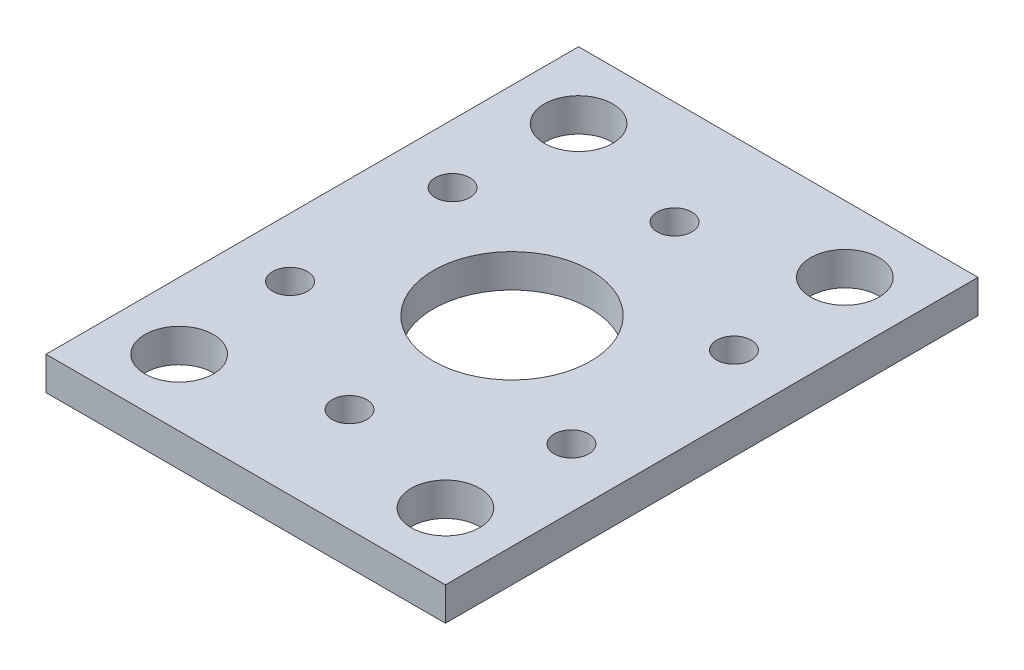
ISO-10303-21;
HEADER;
FILE_DESCRIPTION(('STEP AP214'),'2;1');
FILE_NAME('part.step','',(''),(''),'','','');
FILE_SCHEMA(('AUTOMOTIVE_DESIGN { 1 0 10303 214 1 1 1 1 }'));
ENDSEC;
DATA;
#1=APPLICATION_CONTEXT('core data for automotive mechanical design processes');
#2=APPLICATION_PROTOCOL_DEFINITION('international standard','automotive_design',2000,#1);
#3=PRODUCT_CONTEXT('',#1,'mechanical');
#4=PRODUCT('Part','Part','',(#3));
#5=PRODUCT_RELATED_PRODUCT_CATEGORY('part','',(#4));
#6=PRODUCT_DEFINITION_FORMATION('','',#4);
#7=PRODUCT_DEFINITION_CONTEXT('part definition',#1,'design');
#8=PRODUCT_DEFINITION('design','',#6,#7);
#9=PRODUCT_DEFINITION_SHAPE('','',#8);
#10=(LENGTH_UNIT() NAMED_UNIT(*) SI_UNIT(.MILLI.,.METRE.));
#11=(NAMED_UNIT(*) PLANE_ANGLE_UNIT() SI_UNIT($,.RADIAN.));
#12=(NAMED_UNIT(*) SI_UNIT($,.STERADIAN.) SOLID_ANGLE_UNIT());
#13=UNCERTAINTY_MEASURE_WITH_UNIT(LENGTH_MEASURE(1.E-05),#10,'distance_accuracy_value','');
#14=(GEOMETRIC_REPRESENTATION_CONTEXT(3) GLOBAL_UNCERTAINTY_ASSIGNED_CONTEXT((#13)) GLOBAL_UNIT_ASSIGNED_CONTEXT((#10,
#11,#12)) REPRESENTATION_CONTEXT('',''));
#15=CARTESIAN_POINT('',(0.,0.,0.));
#16=DIRECTION('',(0.,0.,1.));
#17=DIRECTION('',(1.,0.,0.));
#18=AXIS2_PLACEMENT_3D('',#15,#16,#17);
#19=CARTESIAN_POINT('',(0.,3.175,0.));
#20=DIRECTION('',(0.,-1.,0.));
#21=DIRECTION('',(0.,0.,-1.));
#22=AXIS2_PLACEMENT_3D('',#19,#20,#21);
#23=PLANE('',#22);
#24=DIRECTION('',(1.,0.,0.));
#25=VECTOR('',#24,1.);
#26=CARTESIAN_POINT('',(0.,3.175,50.8));
#27=LINE('',#26,#25);
#28=CARTESIAN_POINT('',(0.,3.175,50.8));
#29=VERTEX_POINT('',#28);
#30=CARTESIAN_POINT('',(38.1,3.175,50.8));
#31=VERTEX_POINT('',#30);
#32=EDGE_CURVE('E89',#29,#31,#27,.T.);
#33=ORIENTED_EDGE('',*,*,#32,.T.);
#34=DIRECTION('',(0.,0.,-1.));
#35=VECTOR('',#34,1.);
#36=CARTESIAN_POINT('',(38.1,3.175,0.));
#37=LINE('',#36,#35);
#38=CARTESIAN_POINT('',(38.1,3.175,0.));
#39=VERTEX_POINT('',#38);
#40=EDGE_CURVE('E84',#31,#39,#37,.T.);
#41=ORIENTED_EDGE('',*,*,#40,.T.);
#42=DIRECTION('',(-1.,0.,0.));
#43=VECTOR('',#42,1.);
#44=CARTESIAN_POINT('',(0.,3.175,0.));
#45=LINE('',#44,#43);
#46=CARTESIAN_POINT('',(0.,3.175,0.));
#47=VERTEX_POINT('',#46);
#48=EDGE_CURVE('E87',#39,#47,#45,.T.);
#49=ORIENTED_EDGE('',*,*,#48,.T.);
#50=DIRECTION('',(0.,0.,1.));
#51=VECTOR('',#50,1.);
#52=CARTESIAN_POINT('',(0.,3.175,50.8));
#53=LINE('',#52,#51);
#54=EDGE_CURVE('E54',#47,#29,#53,.T.);
#55=ORIENTED_EDGE('',*,*,#54,.T.);
#56=EDGE_LOOP('',(#33,#41,#49,#55));
#57=FACE_BOUND('',#56,.T.);
#58=CARTESIAN_POINT('',(19.05,3.175,40.9));
#59=DIRECTION('',(0.,1.,0.));
#60=DIRECTION('',(0.,0.,1.));
#61=AXIS2_PLACEMENT_3D('',#58,#59,#60);
#62=CIRCLE('',#61,1.65);
#63=CARTESIAN_POINT('',(19.05,3.175,42.55));
#64=VERTEX_POINT('',#63);
#65=EDGE_CURVE('E104',#64,#64,#62,.T.);
#66=ORIENTED_EDGE('',*,*,#65,.F.);
#67=EDGE_LOOP('',(#66));
#68=FACE_BOUND('',#67,.T.);
#69=CARTESIAN_POINT('',(6.35,3.175,6.35));
#70=DIRECTION('',(0.,1.,0.));
#71=DIRECTION('',(0.,0.,1.));
#72=AXIS2_PLACEMENT_3D('',#69,#70,#71);
#73=CIRCLE('',#72,3.2639);
#74=CARTESIAN_POINT('',(6.35,3.175,9.6139));
#75=VERTEX_POINT('',#74);
#76=EDGE_CURVE('E119',#75,#75,#73,.T.);
#77=ORIENTED_EDGE('',*,*,#76,.F.);
#78=EDGE_LOOP('',(#77));
#79=FACE_BOUND('',#78,.T.);
#80=CARTESIAN_POINT('',(5.6266062413412,3.175,33.15));
#81=DIRECTION('',(0.,1.,0.));
#82=DIRECTION('',(0.,0.,1.));
#83=AXIS2_PLACEMENT_3D('',#80,#81,#82);
#84=CIRCLE('',#83,1.65);
#85=CARTESIAN_POINT('',(5.6266062413412,3.175,34.8));
#86=VERTEX_POINT('',#85);
#87=EDGE_CURVE('E125',#86,#86,#84,.T.);
#88=ORIENTED_EDGE('',*,*,#87,.F.);
#89=EDGE_LOOP('',(#88));
#90=FACE_BOUND('',#89,.T.);
#91=CARTESIAN_POINT('',(5.6266062413412,3.175,17.65));
#92=DIRECTION('',(0.,1.,0.));
#93=DIRECTION('',(0.,0.,1.));
#94=AXIS2_PLACEMENT_3D('',#91,#92,#93);
#95=CIRCLE('',#94,1.65);
#96=CARTESIAN_POINT('',(5.6266062413412,3.175,19.3));
#97=VERTEX_POINT('',#96);
#98=EDGE_CURVE('E131',#97,#97,#95,.T.);
#99=ORIENTED_EDGE('',*,*,#98,.F.);
#100=EDGE_LOOP('',(#99));
#101=FACE_BOUND('',#100,.T.);
#102=CARTESIAN_POINT('',(19.05,3.175,9.9));
#103=DIRECTION('',(0.,1.,0.));
#104=DIRECTION('',(0.,0.,1.));
#105=AXIS2_PLACEMENT_3D('',#102,#103,#104);
#106=CIRCLE('',#105,1.65);
#107=CARTESIAN_POINT('',(19.05,3.175,11.55));
#108=VERTEX_POINT('',#107);
#109=EDGE_CURVE('E137',#108,#108,#106,.T.);
#110=ORIENTED_EDGE('',*,*,#109,.F.);
#111=EDGE_LOOP('',(#110));
#112=FACE_BOUND('',#111,.T.);
#113=CARTESIAN_POINT('',(32.4733937586588,3.175,17.65));
#114=DIRECTION('',(0.,1.,0.));
#115=DIRECTION('',(0.,0.,1.));
#116=AXIS2_PLACEMENT_3D('',#113,#114,#115);
#117=CIRCLE('',#116,1.65);
#118=CARTESIAN_POINT('',(32.4733937586588,3.175,19.3));
#119=VERTEX_POINT('',#118);
#120=EDGE_CURVE('E143',#119,#119,#117,.T.);
#121=ORIENTED_EDGE('',*,*,#120,.F.);
#122=EDGE_LOOP('',(#121));
#123=FACE_BOUND('',#122,.T.);
#124=CARTESIAN_POINT('',(32.4733937586588,3.175,33.15));
#125=DIRECTION('',(0.,1.,0.));
#126=DIRECTION('',(0.,0.,1.));
#127=AXIS2_PLACEMENT_3D('',#124,#125,#126);
#128=CIRCLE('',#127,1.65);
#129=CARTESIAN_POINT('',(32.4733937586588,3.175,34.8));
#130=VERTEX_POINT('',#129);
#131=EDGE_CURVE('E149',#130,#130,#128,.T.);
#132=ORIENTED_EDGE('',*,*,#131,.F.);
#133=EDGE_LOOP('',(#132));
#134=FACE_BOUND('',#133,.T.);
#135=CARTESIAN_POINT('',(31.75,3.175,6.35));
#136=DIRECTION('',(0.,1.,0.));
#137=DIRECTION('',(0.,0.,1.));
#138=AXIS2_PLACEMENT_3D('',#135,#136,#137);
#139=CIRCLE('',#138,3.2639);
#140=CARTESIAN_POINT('',(31.75,3.175,9.6139));
#141=VERTEX_POINT('',#140);
#142=EDGE_CURVE('E155',#141,#141,#139,.T.);
#143=ORIENTED_EDGE('',*,*,#142,.F.);
#144=EDGE_LOOP('',(#143));
#145=FACE_BOUND('',#144,.T.);
#146=CARTESIAN_POINT('',(6.35,3.175,44.45));
#147=DIRECTION('',(0.,1.,0.));
#148=DIRECTION('',(0.,0.,1.));
#149=AXIS2_PLACEMENT_3D('',#146,#147,#148);
#150=CIRCLE('',#149,3.2639);
#151=CARTESIAN_POINT('',(6.35,3.175,47.7139));
#152=VERTEX_POINT('',#151);
#153=EDGE_CURVE('E161',#152,#152,#150,.T.);
#154=ORIENTED_EDGE('',*,*,#153,.F.);
#155=EDGE_LOOP('',(#154));
#156=FACE_BOUND('',#155,.T.);
#157=CARTESIAN_POINT('',(19.05,3.175,25.4));
#158=DIRECTION('',(0.,1.,0.));
#159=DIRECTION('',(0.,0.,1.));
#160=AXIS2_PLACEMENT_3D('',#157,#158,#159);
#161=CIRCLE('',#160,7.50000000000001);
#162=CARTESIAN_POINT('',(19.05,3.175,32.9));
#163=VERTEX_POINT('',#162);
#164=EDGE_CURVE('E167',#163,#163,#161,.T.);
#165=ORIENTED_EDGE('',*,*,#164,.F.);
#166=EDGE_LOOP('',(#165));
#167=FACE_BOUND('',#166,.T.);
#168=CARTESIAN_POINT('',(31.75,3.175,44.45));
#169=DIRECTION('',(0.,1.,0.));
#170=DIRECTION('',(0.,0.,1.));
#171=AXIS2_PLACEMENT_3D('',#168,#169,#170);
#172=CIRCLE('',#171,3.2639);
#173=CARTESIAN_POINT('',(31.75,3.175,47.7139));
#174=VERTEX_POINT('',#173);
#175=EDGE_CURVE('E173',#174,#174,#172,.T.);
#176=ORIENTED_EDGE('',*,*,#175,.F.);
#177=EDGE_LOOP('',(#176));
#178=FACE_BOUND('',#177,.T.);
#179=ADVANCED_FACE('F37',(#57,#68,#79,#90,#101,#112,#123,#134,#145,#156,#167,#178),#23,.F.);
#180=CARTESIAN_POINT('',(0.,0.,0.));
#181=DIRECTION('',(0.,-1.,0.));
#182=DIRECTION('',(0.,0.,-1.));
#183=AXIS2_PLACEMENT_3D('',#180,#181,#182);
#184=PLANE('',#183);
#185=CARTESIAN_POINT('',(19.05,0.,25.4));
#186=DIRECTION('',(0.,1.,0.));
#187=DIRECTION('',(0.,0.,1.));
#188=AXIS2_PLACEMENT_3D('',#185,#186,#187);
#189=CIRCLE('',#188,7.50000000000001);
#190=CARTESIAN_POINT('',(19.05,0.,32.9));
#191=VERTEX_POINT('',#190);
#192=EDGE_CURVE('E170',#191,#191,#189,.T.);
#193=ORIENTED_EDGE('',*,*,#192,.T.);
#194=EDGE_LOOP('',(#193));
#195=FACE_BOUND('',#194,.T.);
#196=CARTESIAN_POINT('',(31.75,0.,6.35));
#197=DIRECTION('',(0.,1.,0.));
#198=DIRECTION('',(0.,0.,1.));
#199=AXIS2_PLACEMENT_3D('',#196,#197,#198);
#200=CIRCLE('',#199,3.2639);
#201=CARTESIAN_POINT('',(31.75,0.,9.6139));
#202=VERTEX_POINT('',#201);
#203=EDGE_CURVE('E158',#202,#202,#200,.T.);
#204=ORIENTED_EDGE('',*,*,#203,.T.);
#205=EDGE_LOOP('',(#204));
#206=FACE_BOUND('',#205,.T.);
#207=CARTESIAN_POINT('',(32.4733937586588,0.,17.65));
#208=DIRECTION('',(0.,1.,0.));
#209=DIRECTION('',(0.,0.,1.));
#210=AXIS2_PLACEMENT_3D('',#207,#208,#209);
#211=CIRCLE('',#210,1.65);
#212=CARTESIAN_POINT('',(32.4733937586588,0.,19.3));
#213=VERTEX_POINT('',#212);
#214=EDGE_CURVE('E146',#213,#213,#211,.T.);
#215=ORIENTED_EDGE('',*,*,#214,.T.);
#216=EDGE_LOOP('',(#215));
#217=FACE_BOUND('',#216,.T.);
#218=CARTESIAN_POINT('',(5.6266062413412,0.,17.65));
#219=DIRECTION('',(0.,1.,0.));
#220=DIRECTION('',(0.,0.,1.));
#221=AXIS2_PLACEMENT_3D('',#218,#219,#220);
#222=CIRCLE('',#221,1.65);
#223=CARTESIAN_POINT('',(5.6266062413412,0.,19.3));
#224=VERTEX_POINT('',#223);
#225=EDGE_CURVE('E134',#224,#224,#222,.T.);
#226=ORIENTED_EDGE('',*,*,#225,.T.);
#227=EDGE_LOOP('',(#226));
#228=FACE_BOUND('',#227,.T.);
#229=CARTESIAN_POINT('',(6.35,0.,6.35));
#230=DIRECTION('',(0.,1.,0.));
#231=DIRECTION('',(0.,0.,1.));
#232=AXIS2_PLACEMENT_3D('',#229,#230,#231);
#233=CIRCLE('',#232,3.2639);
#234=CARTESIAN_POINT('',(6.35,0.,9.6139));
#235=VERTEX_POINT('',#234);
#236=EDGE_CURVE('E122',#235,#235,#233,.T.);
#237=ORIENTED_EDGE('',*,*,#236,.T.);
#238=EDGE_LOOP('',(#237));
#239=FACE_BOUND('',#238,.T.);
#240=DIRECTION('',(1.,0.,0.));
#241=VECTOR('',#240,1.);
#242=CARTESIAN_POINT('',(0.,0.,50.8));
#243=LINE('',#242,#241);
#244=CARTESIAN_POINT('',(0.,0.,50.8));
#245=VERTEX_POINT('',#244);
#246=CARTESIAN_POINT('',(38.1,0.,50.8));
#247=VERTEX_POINT('',#246);
#248=EDGE_CURVE('E101',#245,#247,#243,.T.);
#249=ORIENTED_EDGE('',*,*,#248,.F.);
#250=DIRECTION('',(0.,0.,1.));
#251=VECTOR('',#250,1.);
#252=CARTESIAN_POINT('',(0.,0.,50.8));
#253=LINE('',#252,#251);
#254=CARTESIAN_POINT('',(0.,0.,0.));
#255=VERTEX_POINT('',#254);
#256=EDGE_CURVE('E77',#255,#245,#253,.T.);
#257=ORIENTED_EDGE('',*,*,#256,.F.);
#258=DIRECTION('',(-1.,0.,0.));
#259=VECTOR('',#258,1.);
#260=CARTESIAN_POINT('',(0.,0.,0.));
#261=LINE('',#260,#259);
#262=CARTESIAN_POINT('',(38.1,0.,0.));
#263=VERTEX_POINT('',#262);
#264=EDGE_CURVE('E71',#263,#255,#261,.T.);
#265=ORIENTED_EDGE('',*,*,#264,.F.);
#266=DIRECTION('',(0.,0.,-1.));
#267=VECTOR('',#266,1.);
#268=CARTESIAN_POINT('',(38.1,0.,0.));
#269=LINE('',#268,#267);
#270=EDGE_CURVE('E93',#247,#263,#269,.T.);
#271=ORIENTED_EDGE('',*,*,#270,.F.);
#272=EDGE_LOOP('',(#249,#257,#265,#271));
#273=FACE_BOUND('',#272,.T.);
#274=CARTESIAN_POINT('',(19.05,0.,40.9));
#275=DIRECTION('',(0.,1.,0.));
#276=DIRECTION('',(0.,0.,1.));
#277=AXIS2_PLACEMENT_3D('',#274,#275,#276);
#278=CIRCLE('',#277,1.65);
#279=CARTESIAN_POINT('',(19.05,0.,42.55));
#280=VERTEX_POINT('',#279);
#281=EDGE_CURVE('E116',#280,#280,#278,.T.);
#282=ORIENTED_EDGE('',*,*,#281,.T.);
#283=EDGE_LOOP('',(#282));
#284=FACE_BOUND('',#283,.T.);
#285=CARTESIAN_POINT('',(5.6266062413412,0.,33.15));
#286=DIRECTION('',(0.,1.,0.));
#287=DIRECTION('',(0.,0.,1.));
#288=AXIS2_PLACEMENT_3D('',#285,#286,#287);
#289=CIRCLE('',#288,1.65);
#290=CARTESIAN_POINT('',(5.6266062413412,0.,34.8));
#291=VERTEX_POINT('',#290);
#292=EDGE_CURVE('E128',#291,#291,#289,.T.);
#293=ORIENTED_EDGE('',*,*,#292,.T.);
#294=EDGE_LOOP('',(#293));
#295=FACE_BOUND('',#294,.T.);
#296=CARTESIAN_POINT('',(19.05,0.,9.9));
#297=DIRECTION('',(0.,1.,0.));
#298=DIRECTION('',(0.,0.,1.));
#299=AXIS2_PLACEMENT_3D('',#296,#297,#298);
#300=CIRCLE('',#299,1.65);
#301=CARTESIAN_POINT('',(19.05,0.,11.55));
#302=VERTEX_POINT('',#301);
#303=EDGE_CURVE('E140',#302,#302,#300,.T.);
#304=ORIENTED_EDGE('',*,*,#303,.T.);
#305=EDGE_LOOP('',(#304));
#306=FACE_BOUND('',#305,.T.);
#307=CARTESIAN_POINT('',(32.4733937586588,0.,33.15));
#308=DIRECTION('',(0.,1.,0.));
#309=DIRECTION('',(0.,0.,1.));
#310=AXIS2_PLACEMENT_3D('',#307,#308,#309);
#311=CIRCLE('',#310,1.65);
#312=CARTESIAN_POINT('',(32.4733937586588,0.,34.8));
#313=VERTEX_POINT('',#312);
#314=EDGE_CURVE('E152',#313,#313,#311,.T.);
#315=ORIENTED_EDGE('',*,*,#314,.T.);
#316=EDGE_LOOP('',(#315));
#317=FACE_BOUND('',#316,.T.);
#318=CARTESIAN_POINT('',(6.35,0.,44.45));
#319=DIRECTION('',(0.,1.,0.));
#320=DIRECTION('',(0.,0.,1.));
#321=AXIS2_PLACEMENT_3D('',#318,#319,#320);
#322=CIRCLE('',#321,3.2639);
#323=CARTESIAN_POINT('',(6.35,0.,47.7139));
#324=VERTEX_POINT('',#323);
#325=EDGE_CURVE('E164',#324,#324,#322,.T.);
#326=ORIENTED_EDGE('',*,*,#325,.T.);
#327=EDGE_LOOP('',(#326));
#328=FACE_BOUND('',#327,.T.);
#329=CARTESIAN_POINT('',(31.75,0.,44.45));
#330=DIRECTION('',(0.,1.,0.));
#331=DIRECTION('',(0.,0.,1.));
#332=AXIS2_PLACEMENT_3D('',#329,#330,#331);
#333=CIRCLE('',#332,3.2639);
#334=CARTESIAN_POINT('',(31.75,0.,47.7139));
#335=VERTEX_POINT('',#334);
#336=EDGE_CURVE('E176',#335,#335,#333,.T.);
#337=ORIENTED_EDGE('',*,*,#336,.T.);
#338=EDGE_LOOP('',(#337));
#339=FACE_BOUND('',#338,.T.);
#340=ADVANCED_FACE('F112',(#195,#206,#217,#228,#239,#273,#284,#295,#306,#317,#328,#339),#184,.T.);
#341=CARTESIAN_POINT('',(0.,3.175,50.8));
#342=DIRECTION('',(0.,0.,-1.));
#343=DIRECTION('',(-1.,0.,0.));
#344=AXIS2_PLACEMENT_3D('',#341,#342,#343);
#345=PLANE('',#344);
#346=ORIENTED_EDGE('',*,*,#248,.T.);
#347=DIRECTION('',(0.,-1.,0.));
#348=VECTOR('',#347,1.);
#349=CARTESIAN_POINT('',(38.1,3.175,50.8));
#350=LINE('',#349,#348);
#351=EDGE_CURVE('E11',#31,#247,#350,.T.);
#352=ORIENTED_EDGE('',*,*,#351,.F.);
#353=ORIENTED_EDGE('',*,*,#32,.F.);
#354=DIRECTION('',(0.,-1.,0.));
#355=VECTOR('',#354,1.);
#356=CARTESIAN_POINT('',(0.,3.175,50.8));
#357=LINE('',#356,#355);
#358=EDGE_CURVE('E97',#29,#245,#357,.T.);
#359=ORIENTED_EDGE('',*,*,#358,.T.);
#360=EDGE_LOOP('',(#346,#352,#353,#359));
#361=FACE_BOUND('',#360,.T.);
#362=ADVANCED_FACE('F39',(#361),#345,.F.);
#363=CARTESIAN_POINT('',(38.1,3.175,0.));
#364=DIRECTION('',(-1.,0.,0.));
#365=DIRECTION('',(0.,0.,1.));
#366=AXIS2_PLACEMENT_3D('',#363,#364,#365);
#367=PLANE('',#366);
#368=ORIENTED_EDGE('',*,*,#270,.T.);
#369=DIRECTION('',(0.,-1.,0.));
#370=VECTOR('',#369,1.);
#371=CARTESIAN_POINT('',(38.1,3.175,0.));
#372=LINE('',#371,#370);
#373=EDGE_CURVE('E46',#39,#263,#372,.T.);
#374=ORIENTED_EDGE('',*,*,#373,.F.);
#375=ORIENTED_EDGE('',*,*,#40,.F.);
#376=ORIENTED_EDGE('',*,*,#351,.T.);
#377=EDGE_LOOP('',(#368,#374,#375,#376));
#378=FACE_BOUND('',#377,.T.);
#379=ADVANCED_FACE('F92',(#378),#367,.F.);
#380=CARTESIAN_POINT('',(0.,3.175,0.));
#381=DIRECTION('',(0.,0.,1.));
#382=DIRECTION('',(1.,0.,0.));
#383=AXIS2_PLACEMENT_3D('',#380,#381,#382);
#384=PLANE('',#383);
#385=ORIENTED_EDGE('',*,*,#264,.T.);
#386=DIRECTION('',(0.,-1.,0.));
#387=VECTOR('',#386,1.);
#388=CARTESIAN_POINT('',(0.,3.175,0.));
#389=LINE('',#388,#387);
#390=EDGE_CURVE('E94',#47,#255,#389,.T.);
#391=ORIENTED_EDGE('',*,*,#390,.F.);
#392=ORIENTED_EDGE('',*,*,#48,.F.);
#393=ORIENTED_EDGE('',*,*,#373,.T.);
#394=EDGE_LOOP('',(#385,#391,#392,#393));
#395=FACE_BOUND('',#394,.T.);
#396=ADVANCED_FACE('F95',(#395),#384,.F.);
#397=CARTESIAN_POINT('',(0.,3.175,50.8));
#398=DIRECTION('',(1.,0.,0.));
#399=DIRECTION('',(0.,0.,-1.));
#400=AXIS2_PLACEMENT_3D('',#397,#398,#399);
#401=PLANE('',#400);
#402=ORIENTED_EDGE('',*,*,#256,.T.);
#403=ORIENTED_EDGE('',*,*,#358,.F.);
#404=ORIENTED_EDGE('',*,*,#54,.F.);
#405=ORIENTED_EDGE('',*,*,#390,.T.);
#406=EDGE_LOOP('',(#402,#403,#404,#405));
#407=FACE_BOUND('',#406,.T.);
#408=ADVANCED_FACE('F109',(#407),#401,.F.);
#409=CARTESIAN_POINT('',(19.05,3.175,40.9));
#410=DIRECTION('',(0.,-1.,0.));
#411=DIRECTION('',(0.,0.,-1.));
#412=AXIS2_PLACEMENT_3D('',#409,#410,#411);
#413=CYLINDRICAL_SURFACE('',#412,1.65);
#414=ORIENTED_EDGE('',*,*,#65,.T.);
#415=EDGE_LOOP('',(#414));
#416=FACE_BOUND('',#415,.T.);
#417=ORIENTED_EDGE('',*,*,#281,.F.);
#418=EDGE_LOOP('',(#417));
#419=FACE_BOUND('',#418,.T.);
#420=ADVANCED_FACE('F193',(#416,#419),#413,.F.);
#421=CARTESIAN_POINT('',(6.35,3.175,6.35));
#422=DIRECTION('',(0.,-1.,0.));
#423=DIRECTION('',(0.,0.,-1.));
#424=AXIS2_PLACEMENT_3D('',#421,#422,#423);
#425=CYLINDRICAL_SURFACE('',#424,3.2639);
#426=ORIENTED_EDGE('',*,*,#76,.T.);
#427=EDGE_LOOP('',(#426));
#428=FACE_BOUND('',#427,.T.);
#429=ORIENTED_EDGE('',*,*,#236,.F.);
#430=EDGE_LOOP('',(#429));
#431=FACE_BOUND('',#430,.T.);
#432=ADVANCED_FACE('F247',(#428,#431),#425,.F.);
#433=CARTESIAN_POINT('',(5.6266062413412,3.175,33.15));
#434=DIRECTION('',(0.,-1.,0.));
#435=DIRECTION('',(0.,0.,-1.));
#436=AXIS2_PLACEMENT_3D('',#433,#434,#435);
#437=CYLINDRICAL_SURFACE('',#436,1.65);
#438=ORIENTED_EDGE('',*,*,#87,.T.);
#439=EDGE_LOOP('',(#438));
#440=FACE_BOUND('',#439,.T.);
#441=ORIENTED_EDGE('',*,*,#292,.F.);
#442=EDGE_LOOP('',(#441));
#443=FACE_BOUND('',#442,.T.);
#444=ADVANCED_FACE('F256',(#440,#443),#437,.F.);
#445=CARTESIAN_POINT('',(5.6266062413412,3.175,17.65));
#446=DIRECTION('',(0.,-1.,0.));
#447=DIRECTION('',(0.,0.,-1.));
#448=AXIS2_PLACEMENT_3D('',#445,#446,#447);
#449=CYLINDRICAL_SURFACE('',#448,1.65);
#450=ORIENTED_EDGE('',*,*,#98,.T.);
#451=EDGE_LOOP('',(#450));
#452=FACE_BOUND('',#451,.T.);
#453=ORIENTED_EDGE('',*,*,#225,.F.);
#454=EDGE_LOOP('',(#453));
#455=FACE_BOUND('',#454,.T.);
#456=ADVANCED_FACE('F265',(#452,#455),#449,.F.);
#457=CARTESIAN_POINT('',(19.05,3.175,9.9));
#458=DIRECTION('',(0.,-1.,0.));
#459=DIRECTION('',(0.,0.,-1.));
#460=AXIS2_PLACEMENT_3D('',#457,#458,#459);
#461=CYLINDRICAL_SURFACE('',#460,1.65);
#462=ORIENTED_EDGE('',*,*,#109,.T.);
#463=EDGE_LOOP('',(#462));
#464=FACE_BOUND('',#463,.T.);
#465=ORIENTED_EDGE('',*,*,#303,.F.);
#466=EDGE_LOOP('',(#465));
#467=FACE_BOUND('',#466,.T.);
#468=ADVANCED_FACE('F275',(#464,#467),#461,.F.);
#469=CARTESIAN_POINT('',(32.4733937586588,3.175,17.65));
#470=DIRECTION('',(0.,-1.,0.));
#471=DIRECTION('',(0.,0.,-1.));
#472=AXIS2_PLACEMENT_3D('',#469,#470,#471);
#473=CYLINDRICAL_SURFACE('',#472,1.65);
#474=ORIENTED_EDGE('',*,*,#120,.T.);
#475=EDGE_LOOP('',(#474));
#476=FACE_BOUND('',#475,.T.);
#477=ORIENTED_EDGE('',*,*,#214,.F.);
#478=EDGE_LOOP('',(#477));
#479=FACE_BOUND('',#478,.T.);
#480=ADVANCED_FACE('F285',(#476,#479),#473,.F.);
#481=CARTESIAN_POINT('',(32.4733937586588,3.175,33.15));
#482=DIRECTION('',(0.,-1.,0.));
#483=DIRECTION('',(0.,0.,-1.));
#484=AXIS2_PLACEMENT_3D('',#481,#482,#483);
#485=CYLINDRICAL_SURFACE('',#484,1.65);
#486=ORIENTED_EDGE('',*,*,#131,.T.);
#487=EDGE_LOOP('',(#486));
#488=FACE_BOUND('',#487,.T.);
#489=ORIENTED_EDGE('',*,*,#314,.F.);
#490=EDGE_LOOP('',(#489));
#491=FACE_BOUND('',#490,.T.);
#492=ADVANCED_FACE('F295',(#488,#491),#485,.F.);
#493=CARTESIAN_POINT('',(31.75,3.175,6.35));
#494=DIRECTION('',(0.,-1.,0.));
#495=DIRECTION('',(0.,0.,-1.));
#496=AXIS2_PLACEMENT_3D('',#493,#494,#495);
#497=CYLINDRICAL_SURFACE('',#496,3.2639);
#498=ORIENTED_EDGE('',*,*,#142,.T.);
#499=EDGE_LOOP('',(#498));
#500=FACE_BOUND('',#499,.T.);
#501=ORIENTED_EDGE('',*,*,#203,.F.);
#502=EDGE_LOOP('',(#501));
#503=FACE_BOUND('',#502,.T.);
#504=ADVANCED_FACE('F305',(#500,#503),#497,.F.);
#505=CARTESIAN_POINT('',(6.35,3.175,44.45));
#506=DIRECTION('',(0.,-1.,0.));
#507=DIRECTION('',(0.,0.,-1.));
#508=AXIS2_PLACEMENT_3D('',#505,#506,#507);
#509=CYLINDRICAL_SURFACE('',#508,3.2639);
#510=ORIENTED_EDGE('',*,*,#153,.T.);
#511=EDGE_LOOP('',(#510));
#512=FACE_BOUND('',#511,.T.);
#513=ORIENTED_EDGE('',*,*,#325,.F.);
#514=EDGE_LOOP('',(#513));
#515=FACE_BOUND('',#514,.T.);
#516=ADVANCED_FACE('F315',(#512,#515),#509,.F.);
#517=CARTESIAN_POINT('',(19.05,3.175,25.4));
#518=DIRECTION('',(0.,-1.,0.));
#519=DIRECTION('',(0.,0.,-1.));
#520=AXIS2_PLACEMENT_3D('',#517,#518,#519);
#521=CYLINDRICAL_SURFACE('',#520,7.50000000000001);
#522=ORIENTED_EDGE('',*,*,#164,.T.);
#523=EDGE_LOOP('',(#522));
#524=FACE_BOUND('',#523,.T.);
#525=ORIENTED_EDGE('',*,*,#192,.F.);
#526=EDGE_LOOP('',(#525));
#527=FACE_BOUND('',#526,.T.);
#528=ADVANCED_FACE('F325',(#524,#527),#521,.F.);
#529=CARTESIAN_POINT('',(31.75,3.175,44.45));
#530=DIRECTION('',(0.,-1.,0.));
#531=DIRECTION('',(0.,0.,-1.));
#532=AXIS2_PLACEMENT_3D('',#529,#530,#531);
#533=CYLINDRICAL_SURFACE('',#532,3.2639);
#534=ORIENTED_EDGE('',*,*,#175,.T.);
#535=EDGE_LOOP('',(#534));
#536=FACE_BOUND('',#535,.T.);
#537=ORIENTED_EDGE('',*,*,#336,.F.);
#538=EDGE_LOOP('',(#537));
#539=FACE_BOUND('',#538,.T.);
#540=ADVANCED_FACE('F182',(#536,#539),#533,.F.);
#541=CLOSED_SHELL('',(#179,#340,#362,#379,#396,#408,#420,#432,#444,#456,#468,#480,#492,#504,
#516,#528,#540));
#542=MANIFOLD_SOLID_BREP('B2',#541);
#543=ADVANCED_BREP_SHAPE_REPRESENTATION('',(#18,#542),#14);
#544=SHAPE_DEFINITION_REPRESENTATION(#9,#543);
ENDSEC;
END-ISO-10303-21;
